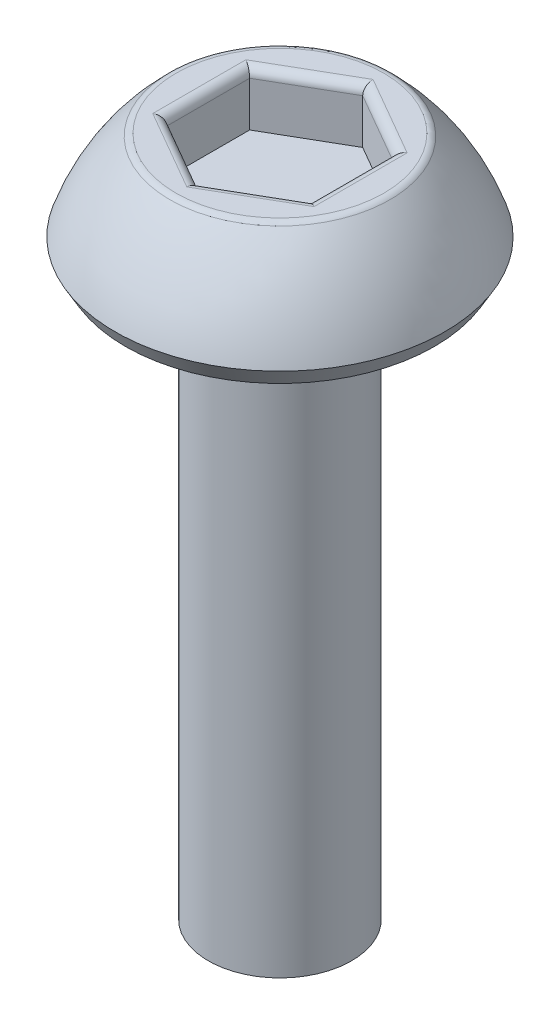
ISO-10303-21;
HEADER;
FILE_DESCRIPTION(('STEP AP214'),'2;1');
FILE_NAME('part.step','',(''),(''),'','','');
FILE_SCHEMA(('AUTOMOTIVE_DESIGN { 1 0 10303 214 1 1 1 1 }'));
ENDSEC;
DATA;
#1=APPLICATION_CONTEXT('core data for automotive mechanical design processes');
#2=APPLICATION_PROTOCOL_DEFINITION('international standard','automotive_design',2000,#1);
#3=PRODUCT_CONTEXT('',#1,'mechanical');
#4=PRODUCT('Part','Part','',(#3));
#5=PRODUCT_RELATED_PRODUCT_CATEGORY('part','',(#4));
#6=PRODUCT_DEFINITION_FORMATION('','',#4);
#7=PRODUCT_DEFINITION_CONTEXT('part definition',#1,'design');
#8=PRODUCT_DEFINITION('design','',#6,#7);
#9=PRODUCT_DEFINITION_SHAPE('','',#8);
#10=(LENGTH_UNIT() NAMED_UNIT(*) SI_UNIT(.MILLI.,.METRE.));
#11=(NAMED_UNIT(*) PLANE_ANGLE_UNIT() SI_UNIT($,.RADIAN.));
#12=(NAMED_UNIT(*) SI_UNIT($,.STERADIAN.) SOLID_ANGLE_UNIT());
#13=UNCERTAINTY_MEASURE_WITH_UNIT(LENGTH_MEASURE(1.E-05),#10,'distance_accuracy_value','');
#14=(GEOMETRIC_REPRESENTATION_CONTEXT(3) GLOBAL_UNCERTAINTY_ASSIGNED_CONTEXT((#13)) GLOBAL_UNIT_ASSIGNED_CONTEXT((#10,
#11,#12)) REPRESENTATION_CONTEXT('',''));
#15=CARTESIAN_POINT('',(0.,0.,0.));
#16=DIRECTION('',(0.,0.,1.));
#17=DIRECTION('',(1.,0.,0.));
#18=AXIS2_PLACEMENT_3D('',#15,#16,#17);
#19=CARTESIAN_POINT('',(0.,1.5,0.));
#20=DIRECTION('',(0.,-1.,0.));
#21=DIRECTION('',(0.,0.,-1.));
#22=AXIS2_PLACEMENT_3D('',#19,#20,#21);
#23=PLANE('',#22);
#24=CARTESIAN_POINT('',(0.,1.5,0.));
#25=DIRECTION('',(0.,-1.,0.));
#26=DIRECTION('',(0.,0.,-1.));
#27=AXIS2_PLACEMENT_3D('',#24,#25,#26);
#28=CIRCLE('',#27,1.45007695941143);
#29=CARTESIAN_POINT('',(0.,1.5,-1.45007695941143));
#30=VERTEX_POINT('',#29);
#31=EDGE_CURVE('E177',#30,#30,#28,.F.);
#32=ORIENTED_EDGE('',*,*,#31,.T.);
#33=EDGE_LOOP('',(#32));
#34=FACE_BOUND('',#33,.T.);
#35=DIRECTION('',(0.866025403784439,0.,-0.5));
#36=VECTOR('',#35,1.);
#37=CARTESIAN_POINT('',(0.5625,1.5,0.974278579257493));
#38=LINE('',#37,#36);
#39=CARTESIAN_POINT('',(1.125,1.5,0.649519052838329));
#40=VERTEX_POINT('',#39);
#41=CARTESIAN_POINT('',(0.,1.5,1.29903810567666));
#42=VERTEX_POINT('',#41);
#43=EDGE_CURVE('E172',#40,#42,#38,.F.);
#44=ORIENTED_EDGE('',*,*,#43,.T.);
#45=DIRECTION('',(0.866025403784439,0.,0.5));
#46=VECTOR('',#45,1.);
#47=CARTESIAN_POINT('',(-0.5625,1.5,0.974278579257493));
#48=LINE('',#47,#46);
#49=CARTESIAN_POINT('',(-1.125,1.5,0.649519052838329));
#50=VERTEX_POINT('',#49);
#51=EDGE_CURVE('E174',#42,#50,#48,.F.);
#52=ORIENTED_EDGE('',*,*,#51,.T.);
#53=DIRECTION('',(0.,0.,1.));
#54=VECTOR('',#53,1.);
#55=CARTESIAN_POINT('',(-1.125,1.5,0.));
#56=LINE('',#55,#54);
#57=CARTESIAN_POINT('',(-1.125,1.5,-0.649519052838329));
#58=VERTEX_POINT('',#57);
#59=EDGE_CURVE('E164',#50,#58,#56,.F.);
#60=ORIENTED_EDGE('',*,*,#59,.T.);
#61=DIRECTION('',(-0.866025403784439,0.,0.5));
#62=VECTOR('',#61,1.);
#63=CARTESIAN_POINT('',(-0.5625,1.5,-0.974278579257493));
#64=LINE('',#63,#62);
#65=CARTESIAN_POINT('',(0.,1.5,-1.29903810567666));
#66=VERTEX_POINT('',#65);
#67=EDGE_CURVE('E166',#58,#66,#64,.F.);
#68=ORIENTED_EDGE('',*,*,#67,.T.);
#69=DIRECTION('',(-0.866025403784439,0.,-0.5));
#70=VECTOR('',#69,1.);
#71=CARTESIAN_POINT('',(0.5625,1.5,-0.974278579257494));
#72=LINE('',#71,#70);
#73=CARTESIAN_POINT('',(1.125,1.5,-0.64951905283833));
#74=VERTEX_POINT('',#73);
#75=EDGE_CURVE('E168',#66,#74,#72,.F.);
#76=ORIENTED_EDGE('',*,*,#75,.T.);
#77=DIRECTION('',(0.,0.,-1.));
#78=VECTOR('',#77,1.);
#79=CARTESIAN_POINT('',(1.125,1.5,0.));
#80=LINE('',#79,#78);
#81=EDGE_CURVE('E170',#74,#40,#80,.F.);
#82=ORIENTED_EDGE('',*,*,#81,.T.);
#83=EDGE_LOOP('',(#44,#52,#60,#68,#76,#82));
#84=FACE_BOUND('',#83,.T.);
#85=ADVANCED_FACE('F35',(#34,#84),#23,.F.);
#86=CARTESIAN_POINT('',(0.,-0.691910970237067,0.));
#87=DIRECTION('',(0.,-1.,0.));
#88=DIRECTION('',(0.,0.,-1.));
#89=AXIS2_PLACEMENT_3D('',#86,#87,#88);
#90=DEGENERATE_TOROIDAL_SURFACE('',#89,0.548298390995416,3.,.F.);
#91=CARTESIAN_POINT('',(0.,1.46486569435813,0.));
#92=DIRECTION('',(0.,-1.,0.));
#93=DIRECTION('',(0.,0.,-1.));
#94=AXIS2_PLACEMENT_3D('',#91,#92,#93);
#95=CIRCLE('',#94,1.53696284421173);
#96=CARTESIAN_POINT('',(0.,1.46486569435813,-1.53696284421173));
#97=VERTEX_POINT('',#96);
#98=EDGE_CURVE('E161',#97,#97,#95,.T.);
#99=ORIENTED_EDGE('',*,*,#98,.T.);
#100=EDGE_LOOP('',(#99));
#101=FACE_BOUND('',#100,.T.);
#102=CARTESIAN_POINT('',(0.,0.25,0.));
#103=DIRECTION('',(0.,-1.,0.));
#104=DIRECTION('',(0.,0.,-1.));
#105=AXIS2_PLACEMENT_3D('',#102,#103,#104);
#106=CIRCLE('',#105,2.3);
#107=CARTESIAN_POINT('',(0.,0.25,-2.3));
#108=VERTEX_POINT('',#107);
#109=EDGE_CURVE('E158',#108,#108,#106,.T.);
#110=ORIENTED_EDGE('',*,*,#109,.F.);
#111=EDGE_LOOP('',(#110));
#112=FACE_BOUND('',#111,.T.);
#113=ADVANCED_FACE('F244',(#101,#112),#90,.F.);
#114=CARTESIAN_POINT('',(0.,0.25,0.));
#115=DIRECTION('',(0.,1.,0.));
#116=DIRECTION('',(0.,0.,1.));
#117=AXIS2_PLACEMENT_3D('',#114,#115,#116);
#118=CONICAL_SURFACE('',#117,2.3,0.523598775598296);
#119=CARTESIAN_POINT('',(0.,0.,0.));
#120=DIRECTION('',(0.,-1.,0.));
#121=DIRECTION('',(0.,0.,-1.));
#122=AXIS2_PLACEMENT_3D('',#119,#120,#121);
#123=CIRCLE('',#122,2.15566243270259);
#124=CARTESIAN_POINT('',(0.,0.,-2.15566243270259));
#125=VERTEX_POINT('',#124);
#126=EDGE_CURVE('E155',#125,#125,#123,.T.);
#127=ORIENTED_EDGE('',*,*,#126,.F.);
#128=EDGE_LOOP('',(#127));
#129=FACE_BOUND('',#128,.T.);
#130=ORIENTED_EDGE('',*,*,#109,.T.);
#131=EDGE_LOOP('',(#130));
#132=FACE_BOUND('',#131,.T.);
#133=ADVANCED_FACE('F250',(#129,#132),#118,.T.);
#134=CARTESIAN_POINT('',(0.,0.,2.15566243270259));
#135=DIRECTION('',(0.,1.,0.));
#136=DIRECTION('',(0.,0.,1.));
#137=AXIS2_PLACEMENT_3D('',#134,#135,#136);
#138=PLANE('',#137);
#139=CARTESIAN_POINT('',(0.,0.,0.));
#140=DIRECTION('',(0.,-1.,0.));
#141=DIRECTION('',(0.,0.,-1.));
#142=AXIS2_PLACEMENT_3D('',#139,#140,#141);
#143=CIRCLE('',#142,1.);
#144=CARTESIAN_POINT('',(0.,0.,-1.));
#145=VERTEX_POINT('',#144);
#146=EDGE_CURVE('E152',#145,#145,#143,.T.);
#147=ORIENTED_EDGE('',*,*,#146,.F.);
#148=EDGE_LOOP('',(#147));
#149=FACE_BOUND('',#148,.T.);
#150=ORIENTED_EDGE('',*,*,#126,.T.);
#151=EDGE_LOOP('',(#150));
#152=FACE_BOUND('',#151,.T.);
#153=ADVANCED_FACE('F269',(#149,#152),#138,.F.);
#154=CARTESIAN_POINT('',(0.,-8.,0.));
#155=DIRECTION('',(0.,-1.,0.));
#156=DIRECTION('',(0.,0.,-1.));
#157=AXIS2_PLACEMENT_3D('',#154,#155,#156);
#158=CYLINDRICAL_SURFACE('',#157,1.);
#159=CARTESIAN_POINT('',(0.,-8.,0.));
#160=DIRECTION('',(0.,-1.,0.));
#161=DIRECTION('',(0.,0.,-1.));
#162=AXIS2_PLACEMENT_3D('',#159,#160,#161);
#163=CIRCLE('',#162,0.999999999999999);
#164=CARTESIAN_POINT('',(0.,-8.,-0.999999999999999));
#165=VERTEX_POINT('',#164);
#166=EDGE_CURVE('E139',#165,#165,#163,.T.);
#167=ORIENTED_EDGE('',*,*,#166,.F.);
#168=EDGE_LOOP('',(#167));
#169=FACE_BOUND('',#168,.T.);
#170=ORIENTED_EDGE('',*,*,#146,.T.);
#171=EDGE_LOOP('',(#170));
#172=FACE_BOUND('',#171,.T.);
#173=ADVANCED_FACE('F274',(#169,#172),#158,.T.);
#174=CARTESIAN_POINT('',(0.,-8.,0.999999999999999));
#175=DIRECTION('',(0.,1.,0.));
#176=DIRECTION('',(0.,0.,1.));
#177=AXIS2_PLACEMENT_3D('',#174,#175,#176);
#178=PLANE('',#177);
#179=ORIENTED_EDGE('',*,*,#166,.T.);
#180=EDGE_LOOP('',(#179));
#181=FACE_BOUND('',#180,.T.);
#182=ADVANCED_FACE('F281',(#181),#178,.F.);
#183=CARTESIAN_POINT('',(0.999999999999999,0.75,-0.577350269189626));
#184=DIRECTION('',(0.5,0.,-0.866025403784439));
#185=DIRECTION('',(-0.866025403784439,0.,-0.5));
#186=AXIS2_PLACEMENT_3D('',#183,#184,#185);
#187=PLANE('',#186);
#188=DIRECTION('',(0.,1.,0.));
#189=VECTOR('',#188,1.);
#190=CARTESIAN_POINT('',(0.999999999999999,0.75,-0.577350269189626));
#191=LINE('',#190,#189);
#192=CARTESIAN_POINT('',(0.999999999999999,0.75,-0.577350269189626));
#193=VERTEX_POINT('',#192);
#194=CARTESIAN_POINT('',(0.999999999999999,1.375,-0.577350269189626));
#195=VERTEX_POINT('',#194);
#196=EDGE_CURVE('E137',#193,#195,#191,.T.);
#197=ORIENTED_EDGE('',*,*,#196,.T.);
#198=DIRECTION('',(-0.866025403784439,0.,-0.5));
#199=VECTOR('',#198,1.);
#200=CARTESIAN_POINT('',(0.999999999999999,1.375,-0.577350269189626));
#201=LINE('',#200,#199);
#202=CARTESIAN_POINT('',(0.,1.375,-1.15470053837925));
#203=VERTEX_POINT('',#202);
#204=EDGE_CURVE('E59',#195,#203,#201,.T.);
#205=ORIENTED_EDGE('',*,*,#204,.T.);
#206=DIRECTION('',(0.,1.,0.));
#207=VECTOR('',#206,1.);
#208=CARTESIAN_POINT('',(0.,0.75,-1.15470053837925));
#209=LINE('',#208,#207);
#210=CARTESIAN_POINT('',(0.,0.75,-1.15470053837925));
#211=VERTEX_POINT('',#210);
#212=EDGE_CURVE('E105',#211,#203,#209,.T.);
#213=ORIENTED_EDGE('',*,*,#212,.F.);
#214=DIRECTION('',(-0.866025403784439,0.,-0.5));
#215=VECTOR('',#214,1.);
#216=CARTESIAN_POINT('',(0.999999999999999,0.75,-0.577350269189626));
#217=LINE('',#216,#215);
#218=EDGE_CURVE('E109',#193,#211,#217,.T.);
#219=ORIENTED_EDGE('',*,*,#218,.F.);
#220=EDGE_LOOP('',(#197,#205,#213,#219));
#221=FACE_BOUND('',#220,.T.);
#222=ADVANCED_FACE('F107',(#221),#187,.F.);
#223=CARTESIAN_POINT('',(1.,0.75,0.577350269189626));
#224=DIRECTION('',(1.,0.,0.));
#225=DIRECTION('',(0.,0.,-1.));
#226=AXIS2_PLACEMENT_3D('',#223,#224,#225);
#227=PLANE('',#226);
#228=DIRECTION('',(0.,1.,0.));
#229=VECTOR('',#228,1.);
#230=CARTESIAN_POINT('',(1.,0.75,0.577350269189626));
#231=LINE('',#230,#229);
#232=CARTESIAN_POINT('',(1.,0.75,0.577350269189626));
#233=VERTEX_POINT('',#232);
#234=CARTESIAN_POINT('',(1.,1.375,0.577350269189626));
#235=VERTEX_POINT('',#234);
#236=EDGE_CURVE('E140',#233,#235,#231,.T.);
#237=ORIENTED_EDGE('',*,*,#236,.T.);
#238=DIRECTION('',(0.,0.,-1.));
#239=VECTOR('',#238,1.);
#240=CARTESIAN_POINT('',(1.,1.375,0.577350269189626));
#241=LINE('',#240,#239);
#242=EDGE_CURVE('E185',#235,#195,#241,.T.);
#243=ORIENTED_EDGE('',*,*,#242,.T.);
#244=ORIENTED_EDGE('',*,*,#196,.F.);
#245=DIRECTION('',(0.,0.,-1.));
#246=VECTOR('',#245,1.);
#247=CARTESIAN_POINT('',(1.,0.75,0.577350269189626));
#248=LINE('',#247,#246);
#249=EDGE_CURVE('E113',#233,#193,#248,.T.);
#250=ORIENTED_EDGE('',*,*,#249,.F.);
#251=EDGE_LOOP('',(#237,#243,#244,#250));
#252=FACE_BOUND('',#251,.T.);
#253=ADVANCED_FACE('F225',(#252),#227,.F.);
#254=CARTESIAN_POINT('',(0.,0.75,1.15470053837925));
#255=DIRECTION('',(0.5,0.,0.866025403784439));
#256=DIRECTION('',(0.866025403784439,0.,-0.5));
#257=AXIS2_PLACEMENT_3D('',#254,#255,#256);
#258=PLANE('',#257);
#259=DIRECTION('',(0.,1.,0.));
#260=VECTOR('',#259,1.);
#261=CARTESIAN_POINT('',(0.,0.75,1.15470053837925));
#262=LINE('',#261,#260);
#263=CARTESIAN_POINT('',(0.,0.75,1.15470053837925));
#264=VERTEX_POINT('',#263);
#265=CARTESIAN_POINT('',(0.,1.375,1.15470053837925));
#266=VERTEX_POINT('',#265);
#267=EDGE_CURVE('E143',#264,#266,#262,.T.);
#268=ORIENTED_EDGE('',*,*,#267,.T.);
#269=DIRECTION('',(0.866025403784439,0.,-0.5));
#270=VECTOR('',#269,1.);
#271=CARTESIAN_POINT('',(0.,1.375,1.15470053837925));
#272=LINE('',#271,#270);
#273=EDGE_CURVE('E183',#266,#235,#272,.T.);
#274=ORIENTED_EDGE('',*,*,#273,.T.);
#275=ORIENTED_EDGE('',*,*,#236,.F.);
#276=DIRECTION('',(0.866025403784439,0.,-0.5));
#277=VECTOR('',#276,1.);
#278=CARTESIAN_POINT('',(0.,0.75,1.15470053837925));
#279=LINE('',#278,#277);
#280=EDGE_CURVE('E134',#264,#233,#279,.T.);
#281=ORIENTED_EDGE('',*,*,#280,.F.);
#282=EDGE_LOOP('',(#268,#274,#275,#281));
#283=FACE_BOUND('',#282,.T.);
#284=ADVANCED_FACE('F226',(#283),#258,.F.);
#285=CARTESIAN_POINT('',(-0.999999999999999,0.75,0.577350269189626));
#286=DIRECTION('',(-0.5,0.,0.866025403784439));
#287=DIRECTION('',(0.866025403784439,0.,0.5));
#288=AXIS2_PLACEMENT_3D('',#285,#286,#287);
#289=PLANE('',#288);
#290=DIRECTION('',(0.,1.,0.));
#291=VECTOR('',#290,1.);
#292=CARTESIAN_POINT('',(-0.999999999999999,0.75,0.577350269189626));
#293=LINE('',#292,#291);
#294=CARTESIAN_POINT('',(-0.999999999999999,0.75,0.577350269189626));
#295=VERTEX_POINT('',#294);
#296=CARTESIAN_POINT('',(-0.999999999999999,1.375,0.577350269189626));
#297=VERTEX_POINT('',#296);
#298=EDGE_CURVE('E146',#295,#297,#293,.T.);
#299=ORIENTED_EDGE('',*,*,#298,.T.);
#300=DIRECTION('',(0.866025403784439,0.,0.5));
#301=VECTOR('',#300,1.);
#302=CARTESIAN_POINT('',(-0.999999999999999,1.375,0.577350269189626));
#303=LINE('',#302,#301);
#304=EDGE_CURVE('E180',#297,#266,#303,.T.);
#305=ORIENTED_EDGE('',*,*,#304,.T.);
#306=ORIENTED_EDGE('',*,*,#267,.F.);
#307=DIRECTION('',(0.866025403784439,0.,0.5));
#308=VECTOR('',#307,1.);
#309=CARTESIAN_POINT('',(-0.999999999999999,0.75,0.577350269189626));
#310=LINE('',#309,#308);
#311=EDGE_CURVE('E131',#295,#264,#310,.T.);
#312=ORIENTED_EDGE('',*,*,#311,.F.);
#313=EDGE_LOOP('',(#299,#305,#306,#312));
#314=FACE_BOUND('',#313,.T.);
#315=ADVANCED_FACE('F221',(#314),#289,.F.);
#316=CARTESIAN_POINT('',(-1.,0.75,-0.577350269189626));
#317=DIRECTION('',(-1.,0.,0.));
#318=DIRECTION('',(0.,0.,1.));
#319=AXIS2_PLACEMENT_3D('',#316,#317,#318);
#320=PLANE('',#319);
#321=DIRECTION('',(0.,1.,0.));
#322=VECTOR('',#321,1.);
#323=CARTESIAN_POINT('',(-1.,0.75,-0.577350269189626));
#324=LINE('',#323,#322);
#325=CARTESIAN_POINT('',(-1.,0.75,-0.577350269189626));
#326=VERTEX_POINT('',#325);
#327=CARTESIAN_POINT('',(-1.,1.375,-0.577350269189626));
#328=VERTEX_POINT('',#327);
#329=EDGE_CURVE('E112',#326,#328,#324,.T.);
#330=ORIENTED_EDGE('',*,*,#329,.T.);
#331=DIRECTION('',(0.,0.,1.));
#332=VECTOR('',#331,1.);
#333=CARTESIAN_POINT('',(-1.,1.375,-0.577350269189626));
#334=LINE('',#333,#332);
#335=EDGE_CURVE('E11',#328,#297,#334,.T.);
#336=ORIENTED_EDGE('',*,*,#335,.T.);
#337=ORIENTED_EDGE('',*,*,#298,.F.);
#338=DIRECTION('',(0.,0.,1.));
#339=VECTOR('',#338,1.);
#340=CARTESIAN_POINT('',(-1.,0.75,-0.577350269189626));
#341=LINE('',#340,#339);
#342=EDGE_CURVE('E121',#326,#295,#341,.T.);
#343=ORIENTED_EDGE('',*,*,#342,.F.);
#344=EDGE_LOOP('',(#330,#336,#337,#343));
#345=FACE_BOUND('',#344,.T.);
#346=ADVANCED_FACE('F218',(#345),#320,.F.);
#347=CARTESIAN_POINT('',(0.,0.75,-1.15470053837925));
#348=DIRECTION('',(-0.5,0.,-0.866025403784438));
#349=DIRECTION('',(-0.866025403784439,0.,0.5));
#350=AXIS2_PLACEMENT_3D('',#347,#348,#349);
#351=PLANE('',#350);
#352=ORIENTED_EDGE('',*,*,#212,.T.);
#353=DIRECTION('',(-0.866025403784439,0.,0.5));
#354=VECTOR('',#353,1.);
#355=CARTESIAN_POINT('',(0.,1.375,-1.15470053837925));
#356=LINE('',#355,#354);
#357=EDGE_CURVE('E44',#203,#328,#356,.T.);
#358=ORIENTED_EDGE('',*,*,#357,.T.);
#359=ORIENTED_EDGE('',*,*,#329,.F.);
#360=DIRECTION('',(-0.866025403784439,0.,0.5));
#361=VECTOR('',#360,1.);
#362=CARTESIAN_POINT('',(0.,0.75,-1.15470053837925));
#363=LINE('',#362,#361);
#364=EDGE_CURVE('E116',#211,#326,#363,.T.);
#365=ORIENTED_EDGE('',*,*,#364,.F.);
#366=EDGE_LOOP('',(#352,#358,#359,#365));
#367=FACE_BOUND('',#366,.T.);
#368=ADVANCED_FACE('F117',(#367),#351,.F.);
#369=CARTESIAN_POINT('',(0.,0.75,0.));
#370=DIRECTION('',(0.,1.,0.));
#371=DIRECTION('',(0.,0.,1.));
#372=AXIS2_PLACEMENT_3D('',#369,#370,#371);
#373=PLANE('',#372);
#374=ORIENTED_EDGE('',*,*,#218,.T.);
#375=ORIENTED_EDGE('',*,*,#364,.T.);
#376=ORIENTED_EDGE('',*,*,#342,.T.);
#377=ORIENTED_EDGE('',*,*,#311,.T.);
#378=ORIENTED_EDGE('',*,*,#280,.T.);
#379=ORIENTED_EDGE('',*,*,#249,.T.);
#380=EDGE_LOOP('',(#374,#375,#376,#377,#378,#379));
#381=FACE_BOUND('',#380,.T.);
#382=ADVANCED_FACE('F123',(#381),#373,.T.);
#383=CARTESIAN_POINT('',(0.,1.375,0.));
#384=DIRECTION('',(0.,-1.,0.));
#385=DIRECTION('',(0.,0.,-1.));
#386=AXIS2_PLACEMENT_3D('',#383,#384,#385);
#387=TOROIDAL_SURFACE('',#386,1.45007695941143,0.125);
#388=ORIENTED_EDGE('',*,*,#31,.F.);
#389=EDGE_LOOP('',(#388));
#390=FACE_BOUND('',#389,.T.);
#391=ORIENTED_EDGE('',*,*,#98,.F.);
#392=EDGE_LOOP('',(#391));
#393=FACE_BOUND('',#392,.T.);
#394=ADVANCED_FACE('F254',(#390,#393),#387,.T.);
#395=CARTESIAN_POINT('',(1.0625,1.375,-0.685603444662681));
#396=DIRECTION('',(-0.866025403784439,0.,-0.5));
#397=DIRECTION('',(-0.5,0.,0.866025403784439));
#398=AXIS2_PLACEMENT_3D('',#395,#396,#397);
#399=CYLINDRICAL_SURFACE('',#398,0.125);
#400=CARTESIAN_POINT('',(1.125,1.375,-0.64951905283833));
#401=DIRECTION('',(-0.5,0.,-0.866025403784438));
#402=DIRECTION('',(0.866025403784439,0.,-0.5));
#403=AXIS2_PLACEMENT_3D('',#400,#401,#402);
#404=ELLIPSE('',#403,0.144337567297406,0.125);
#405=EDGE_CURVE('E128',#74,#195,#404,.F.);
#406=ORIENTED_EDGE('',*,*,#405,.F.);
#407=ORIENTED_EDGE('',*,*,#75,.F.);
#408=CARTESIAN_POINT('',(0.,1.375,-1.29903810567666));
#409=DIRECTION('',(-1.,0.,0.));
#410=DIRECTION('',(0.,0.,-1.));
#411=AXIS2_PLACEMENT_3D('',#408,#409,#410);
#412=ELLIPSE('',#411,0.144337567297406,0.125);
#413=EDGE_CURVE('E39',#203,#66,#412,.T.);
#414=ORIENTED_EDGE('',*,*,#413,.F.);
#415=ORIENTED_EDGE('',*,*,#204,.F.);
#416=EDGE_LOOP('',(#406,#407,#414,#415));
#417=FACE_BOUND('',#416,.T.);
#418=ADVANCED_FACE('F37',(#417),#399,.T.);
#419=CARTESIAN_POINT('',(-0.0625000000000002,1.375,-1.26295371385231));
#420=DIRECTION('',(-0.866025403784439,0.,0.5));
#421=DIRECTION('',(0.5,0.,0.866025403784439));
#422=AXIS2_PLACEMENT_3D('',#419,#420,#421);
#423=CYLINDRICAL_SURFACE('',#422,0.125);
#424=ORIENTED_EDGE('',*,*,#413,.T.);
#425=ORIENTED_EDGE('',*,*,#67,.F.);
#426=CARTESIAN_POINT('',(-1.125,1.375,-0.649519052838329));
#427=DIRECTION('',(-0.5,0.,0.866025403784439));
#428=DIRECTION('',(-0.866025403784439,0.,-0.5));
#429=AXIS2_PLACEMENT_3D('',#426,#427,#428);
#430=ELLIPSE('',#429,0.144337567297406,0.125);
#431=EDGE_CURVE('E196',#328,#58,#430,.T.);
#432=ORIENTED_EDGE('',*,*,#431,.F.);
#433=ORIENTED_EDGE('',*,*,#357,.F.);
#434=EDGE_LOOP('',(#424,#425,#432,#433));
#435=FACE_BOUND('',#434,.T.);
#436=ADVANCED_FACE('F210',(#435),#423,.T.);
#437=CARTESIAN_POINT('',(1.125,1.375,0.577350269189626));
#438=DIRECTION('',(0.,0.,-1.));
#439=DIRECTION('',(-1.,0.,0.));
#440=AXIS2_PLACEMENT_3D('',#437,#438,#439);
#441=CYLINDRICAL_SURFACE('',#440,0.125);
#442=ORIENTED_EDGE('',*,*,#405,.T.);
#443=ORIENTED_EDGE('',*,*,#242,.F.);
#444=CARTESIAN_POINT('',(1.125,1.375,0.649519052838329));
#445=DIRECTION('',(0.5,0.,-0.866025403784439));
#446=DIRECTION('',(0.866025403784439,0.,0.5));
#447=AXIS2_PLACEMENT_3D('',#444,#445,#446);
#448=ELLIPSE('',#447,0.144337567297406,0.125);
#449=EDGE_CURVE('E193',#40,#235,#448,.F.);
#450=ORIENTED_EDGE('',*,*,#449,.F.);
#451=ORIENTED_EDGE('',*,*,#81,.F.);
#452=EDGE_LOOP('',(#442,#443,#450,#451));
#453=FACE_BOUND('',#452,.T.);
#454=ADVANCED_FACE('F203',(#453),#441,.T.);
#455=CARTESIAN_POINT('',(-1.125,1.375,-0.577350269189626));
#456=DIRECTION('',(0.,0.,1.));
#457=DIRECTION('',(1.,0.,0.));
#458=AXIS2_PLACEMENT_3D('',#455,#456,#457);
#459=CYLINDRICAL_SURFACE('',#458,0.125);
#460=ORIENTED_EDGE('',*,*,#431,.T.);
#461=ORIENTED_EDGE('',*,*,#59,.F.);
#462=CARTESIAN_POINT('',(-1.125,1.375,0.649519052838329));
#463=DIRECTION('',(0.5,0.,0.866025403784438));
#464=DIRECTION('',(0.866025403784439,0.,-0.5));
#465=AXIS2_PLACEMENT_3D('',#462,#463,#464);
#466=ELLIPSE('',#465,0.144337567297406,0.125);
#467=EDGE_CURVE('E191',#297,#50,#466,.T.);
#468=ORIENTED_EDGE('',*,*,#467,.F.);
#469=ORIENTED_EDGE('',*,*,#335,.F.);
#470=EDGE_LOOP('',(#460,#461,#468,#469));
#471=FACE_BOUND('',#470,.T.);
#472=ADVANCED_FACE('F215',(#471),#459,.T.);
#473=CARTESIAN_POINT('',(0.0625000000000004,1.375,1.26295371385231));
#474=DIRECTION('',(0.866025403784439,0.,-0.5));
#475=DIRECTION('',(-0.5,0.,-0.866025403784439));
#476=AXIS2_PLACEMENT_3D('',#473,#474,#475);
#477=CYLINDRICAL_SURFACE('',#476,0.125);
#478=ORIENTED_EDGE('',*,*,#449,.T.);
#479=ORIENTED_EDGE('',*,*,#273,.F.);
#480=CARTESIAN_POINT('',(0.,1.375,1.29903810567666));
#481=DIRECTION('',(1.,0.,0.));
#482=DIRECTION('',(0.,0.,1.));
#483=AXIS2_PLACEMENT_3D('',#480,#481,#482);
#484=ELLIPSE('',#483,0.144337567297406,0.125);
#485=EDGE_CURVE('E189',#42,#266,#484,.F.);
#486=ORIENTED_EDGE('',*,*,#485,.F.);
#487=ORIENTED_EDGE('',*,*,#43,.F.);
#488=EDGE_LOOP('',(#478,#479,#486,#487));
#489=FACE_BOUND('',#488,.T.);
#490=ADVANCED_FACE('F230',(#489),#477,.T.);
#491=CARTESIAN_POINT('',(-1.0625,1.375,0.685603444662681));
#492=DIRECTION('',(0.866025403784439,0.,0.5));
#493=DIRECTION('',(0.5,0.,-0.866025403784439));
#494=AXIS2_PLACEMENT_3D('',#491,#492,#493);
#495=CYLINDRICAL_SURFACE('',#494,0.125);
#496=ORIENTED_EDGE('',*,*,#467,.T.);
#497=ORIENTED_EDGE('',*,*,#51,.F.);
#498=ORIENTED_EDGE('',*,*,#485,.T.);
#499=ORIENTED_EDGE('',*,*,#304,.F.);
#500=EDGE_LOOP('',(#496,#497,#498,#499));
#501=FACE_BOUND('',#500,.T.);
#502=ADVANCED_FACE('F235',(#501),#495,.T.);
#503=CLOSED_SHELL('',(#85,#113,#133,#153,#173,#182,#222,#253,#284,#315,#346,#368,#382,#394,#418,
#436,#454,#472,#490,#502));
#504=MANIFOLD_SOLID_BREP('B2',#503);
#505=ADVANCED_BREP_SHAPE_REPRESENTATION('',(#18,#504),#14);
#506=SHAPE_DEFINITION_REPRESENTATION(#9,#505);
ENDSEC;
END-ISO-10303-21;
